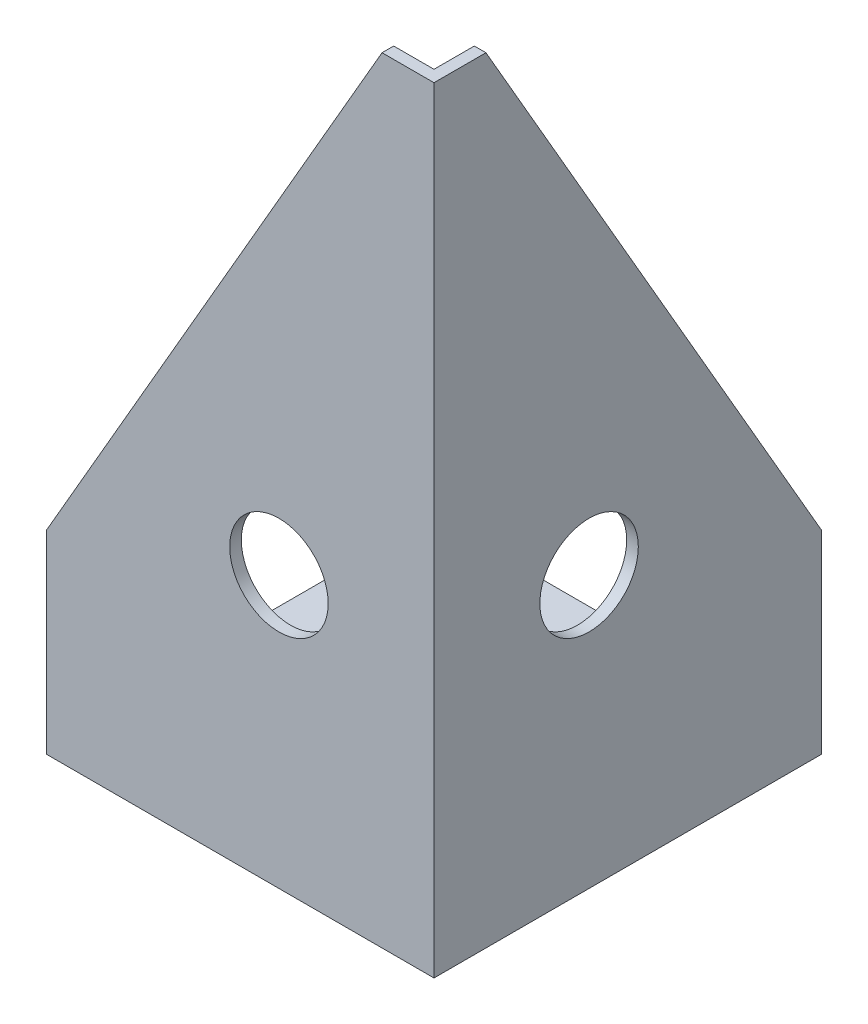
ISO-10303-21;
HEADER;
FILE_DESCRIPTION(('STEP AP214'),'2;1');
FILE_NAME('part.step','',(''),(''),'','','');
FILE_SCHEMA(('AUTOMOTIVE_DESIGN { 1 0 10303 214 1 1 1 1 }'));
ENDSEC;
DATA;
#1=APPLICATION_CONTEXT('core data for automotive mechanical design processes');
#2=APPLICATION_PROTOCOL_DEFINITION('international standard','automotive_design',2000,#1);
#3=PRODUCT_CONTEXT('',#1,'mechanical');
#4=PRODUCT('Part','Part','',(#3));
#5=PRODUCT_RELATED_PRODUCT_CATEGORY('part','',(#4));
#6=PRODUCT_DEFINITION_FORMATION('','',#4);
#7=PRODUCT_DEFINITION_CONTEXT('part definition',#1,'design');
#8=PRODUCT_DEFINITION('design','',#6,#7);
#9=PRODUCT_DEFINITION_SHAPE('','',#8);
#10=(LENGTH_UNIT() NAMED_UNIT(*) SI_UNIT(.MILLI.,.METRE.));
#11=(NAMED_UNIT(*) PLANE_ANGLE_UNIT() SI_UNIT($,.RADIAN.));
#12=(NAMED_UNIT(*) SI_UNIT($,.STERADIAN.) SOLID_ANGLE_UNIT());
#13=UNCERTAINTY_MEASURE_WITH_UNIT(LENGTH_MEASURE(1.E-05),#10,'distance_accuracy_value','');
#14=(GEOMETRIC_REPRESENTATION_CONTEXT(3) GLOBAL_UNCERTAINTY_ASSIGNED_CONTEXT((#13)) GLOBAL_UNIT_ASSIGNED_CONTEXT((#10,
#11,#12)) REPRESENTATION_CONTEXT('',''));
#15=CARTESIAN_POINT('',(0.,0.,0.));
#16=DIRECTION('',(0.,0.,1.));
#17=DIRECTION('',(1.,0.,0.));
#18=AXIS2_PLACEMENT_3D('',#15,#16,#17);
#19=CARTESIAN_POINT('',(0.,200.,0.));
#20=DIRECTION('',(1.,0.,0.));
#21=DIRECTION('',(0.,0.,-1.));
#22=AXIS2_PLACEMENT_3D('',#19,#20,#21);
#23=PLANE('',#22);
#24=DIRECTION('',(0.,-1.,0.));
#25=VECTOR('',#24,1.);
#26=CARTESIAN_POINT('',(0.,200.,0.));
#27=LINE('',#26,#25);
#28=CARTESIAN_POINT('',(0.,49.9999999999991,0.));
#29=VERTEX_POINT('',#28);
#30=CARTESIAN_POINT('',(0.,0.,0.));
#31=VERTEX_POINT('',#30);
#32=EDGE_CURVE('E160',#29,#31,#27,.T.);
#33=ORIENTED_EDGE('',*,*,#32,.F.);
#34=DIRECTION('',(0.,0.,-1.));
#35=VECTOR('',#34,1.);
#36=CARTESIAN_POINT('',(0.,49.9999999999991,0.));
#37=LINE('',#36,#35);
#38=CARTESIAN_POINT('',(0.,49.9999999999992,-3.));
#39=VERTEX_POINT('',#38);
#40=EDGE_CURVE('E170',#29,#39,#37,.T.);
#41=ORIENTED_EDGE('',*,*,#40,.T.);
#42=DIRECTION('',(0.,-1.,0.));
#43=VECTOR('',#42,1.);
#44=CARTESIAN_POINT('',(0.,200.,-3.));
#45=LINE('',#44,#43);
#46=CARTESIAN_POINT('',(0.,3.,-3.));
#47=VERTEX_POINT('',#46);
#48=EDGE_CURVE('E122',#39,#47,#45,.T.);
#49=ORIENTED_EDGE('',*,*,#48,.T.);
#50=DIRECTION('',(0.,0.,1.));
#51=VECTOR('',#50,1.);
#52=CARTESIAN_POINT('',(0.,3.,0.));
#53=LINE('',#52,#51);
#54=CARTESIAN_POINT('',(0.,3.,-100.));
#55=VERTEX_POINT('',#54);
#56=EDGE_CURVE('E112',#55,#47,#53,.T.);
#57=ORIENTED_EDGE('',*,*,#56,.F.);
#58=DIRECTION('',(0.,-1.,0.));
#59=VECTOR('',#58,1.);
#60=CARTESIAN_POINT('',(0.,200.,-100.));
#61=LINE('',#60,#59);
#62=CARTESIAN_POINT('',(0.,0.,-100.));
#63=VERTEX_POINT('',#62);
#64=EDGE_CURVE('E144',#55,#63,#61,.T.);
#65=ORIENTED_EDGE('',*,*,#64,.T.);
#66=DIRECTION('',(0.,0.,1.));
#67=VECTOR('',#66,1.);
#68=CARTESIAN_POINT('',(0.,0.,0.));
#69=LINE('',#68,#67);
#70=EDGE_CURVE('E137',#63,#31,#69,.T.);
#71=ORIENTED_EDGE('',*,*,#70,.T.);
#72=EDGE_LOOP('',(#33,#41,#49,#57,#65,#71));
#73=FACE_BOUND('',#72,.T.);
#74=ADVANCED_FACE('F35',(#73),#23,.F.);
#75=CARTESIAN_POINT('',(0.,200.,-100.));
#76=DIRECTION('',(0.,0.,1.));
#77=DIRECTION('',(1.,0.,0.));
#78=AXIS2_PLACEMENT_3D('',#75,#76,#77);
#79=PLANE('',#78);
#80=DIRECTION('',(0.,-1.,0.));
#81=VECTOR('',#80,1.);
#82=CARTESIAN_POINT('',(97.,200.,-100.));
#83=LINE('',#82,#81);
#84=CARTESIAN_POINT('',(97.,49.9999999999992,-100.));
#85=VERTEX_POINT('',#84);
#86=CARTESIAN_POINT('',(97.,3.,-100.));
#87=VERTEX_POINT('',#86);
#88=EDGE_CURVE('E123',#85,#87,#83,.T.);
#89=ORIENTED_EDGE('',*,*,#88,.F.);
#90=DIRECTION('',(1.,0.,0.));
#91=VECTOR('',#90,1.);
#92=CARTESIAN_POINT('',(0.,49.9999999999992,-100.));
#93=LINE('',#92,#91);
#94=CARTESIAN_POINT('',(100.,49.9999999999992,-100.));
#95=VERTEX_POINT('',#94);
#96=EDGE_CURVE('E43',#85,#95,#93,.T.);
#97=ORIENTED_EDGE('',*,*,#96,.T.);
#98=DIRECTION('',(0.,-1.,0.));
#99=VECTOR('',#98,1.);
#100=CARTESIAN_POINT('',(100.,200.,-100.));
#101=LINE('',#100,#99);
#102=CARTESIAN_POINT('',(100.,0.,-100.));
#103=VERTEX_POINT('',#102);
#104=EDGE_CURVE('E155',#95,#103,#101,.T.);
#105=ORIENTED_EDGE('',*,*,#104,.T.);
#106=DIRECTION('',(-1.,0.,0.));
#107=VECTOR('',#106,1.);
#108=CARTESIAN_POINT('',(0.,0.,-100.));
#109=LINE('',#108,#107);
#110=EDGE_CURVE('E141',#103,#63,#109,.T.);
#111=ORIENTED_EDGE('',*,*,#110,.T.);
#112=ORIENTED_EDGE('',*,*,#64,.F.);
#113=DIRECTION('',(-1.,0.,0.));
#114=VECTOR('',#113,1.);
#115=CARTESIAN_POINT('',(0.,3.,-100.));
#116=LINE('',#115,#114);
#117=EDGE_CURVE('E126',#87,#55,#116,.T.);
#118=ORIENTED_EDGE('',*,*,#117,.F.);
#119=EDGE_LOOP('',(#89,#97,#105,#111,#112,#118));
#120=FACE_BOUND('',#119,.T.);
#121=ADVANCED_FACE('F210',(#120),#79,.F.);
#122=CARTESIAN_POINT('',(0.,200.,0.));
#123=DIRECTION('',(0.,-1.,0.));
#124=DIRECTION('',(0.,0.,-1.));
#125=AXIS2_PLACEMENT_3D('',#122,#123,#124);
#126=PLANE('',#125);
#127=DIRECTION('',(1.,0.,0.));
#128=VECTOR('',#127,1.);
#129=CARTESIAN_POINT('',(0.,200.,-3.));
#130=LINE('',#129,#128);
#131=CARTESIAN_POINT('',(86.6025403784439,200.,-3.));
#132=VERTEX_POINT('',#131);
#133=CARTESIAN_POINT('',(97.,200.,-3.));
#134=VERTEX_POINT('',#133);
#135=EDGE_CURVE('E120',#132,#134,#130,.T.);
#136=ORIENTED_EDGE('',*,*,#135,.F.);
#137=DIRECTION('',(0.,0.,1.));
#138=VECTOR('',#137,1.);
#139=CARTESIAN_POINT('',(86.6025403784439,200.,0.));
#140=LINE('',#139,#138);
#141=CARTESIAN_POINT('',(86.6025403784439,200.,0.));
#142=VERTEX_POINT('',#141);
#143=EDGE_CURVE('E165',#132,#142,#140,.T.);
#144=ORIENTED_EDGE('',*,*,#143,.T.);
#145=DIRECTION('',(1.,0.,0.));
#146=VECTOR('',#145,1.);
#147=CARTESIAN_POINT('',(0.,200.,0.));
#148=LINE('',#147,#146);
#149=CARTESIAN_POINT('',(100.,200.,0.));
#150=VERTEX_POINT('',#149);
#151=EDGE_CURVE('E138',#142,#150,#148,.T.);
#152=ORIENTED_EDGE('',*,*,#151,.T.);
#153=DIRECTION('',(0.,0.,-1.));
#154=VECTOR('',#153,1.);
#155=CARTESIAN_POINT('',(100.,200.,0.));
#156=LINE('',#155,#154);
#157=CARTESIAN_POINT('',(100.,200.,-13.3974596215561));
#158=VERTEX_POINT('',#157);
#159=EDGE_CURVE('E140',#150,#158,#156,.T.);
#160=ORIENTED_EDGE('',*,*,#159,.T.);
#161=DIRECTION('',(-1.,0.,0.));
#162=VECTOR('',#161,1.);
#163=CARTESIAN_POINT('',(0.,200.,-13.3974596215561));
#164=LINE('',#163,#162);
#165=CARTESIAN_POINT('',(97.,200.,-13.3974596215561));
#166=VERTEX_POINT('',#165);
#167=EDGE_CURVE('E162',#158,#166,#164,.T.);
#168=ORIENTED_EDGE('',*,*,#167,.T.);
#169=DIRECTION('',(0.,0.,-1.));
#170=VECTOR('',#169,1.);
#171=CARTESIAN_POINT('',(97.,200.,0.));
#172=LINE('',#171,#170);
#173=EDGE_CURVE('E131',#134,#166,#172,.T.);
#174=ORIENTED_EDGE('',*,*,#173,.F.);
#175=EDGE_LOOP('',(#136,#144,#152,#160,#168,#174));
#176=FACE_BOUND('',#175,.T.);
#177=ADVANCED_FACE('F179',(#176),#126,.F.);
#178=CARTESIAN_POINT('',(0.,200.,0.));
#179=DIRECTION('',(0.,0.,-1.));
#180=DIRECTION('',(-1.,0.,0.));
#181=AXIS2_PLACEMENT_3D('',#178,#179,#180);
#182=PLANE('',#181);
#183=CARTESIAN_POINT('',(60.,70.,0.));
#184=DIRECTION('',(0.,0.,1.));
#185=DIRECTION('',(1.,0.,0.));
#186=AXIS2_PLACEMENT_3D('',#183,#184,#185);
#187=CIRCLE('',#186,12.7);
#188=CARTESIAN_POINT('',(72.7,70.,0.));
#189=VERTEX_POINT('',#188);
#190=EDGE_CURVE('E291',#189,#189,#187,.T.);
#191=ORIENTED_EDGE('',*,*,#190,.F.);
#192=EDGE_LOOP('',(#191));
#193=FACE_BOUND('',#192,.T.);
#194=ORIENTED_EDGE('',*,*,#151,.F.);
#195=DIRECTION('',(0.499999999999998,0.86602540378444,0.));
#196=VECTOR('',#195,1.);
#197=CARTESIAN_POINT('',(86.6025403784439,200.,0.));
#198=LINE('',#197,#196);
#199=EDGE_CURVE('E168',#142,#29,#198,.F.);
#200=ORIENTED_EDGE('',*,*,#199,.T.);
#201=ORIENTED_EDGE('',*,*,#32,.T.);
#202=DIRECTION('',(1.,0.,0.));
#203=VECTOR('',#202,1.);
#204=CARTESIAN_POINT('',(0.,0.,0.));
#205=LINE('',#204,#203);
#206=CARTESIAN_POINT('',(100.,0.,0.));
#207=VERTEX_POINT('',#206);
#208=EDGE_CURVE('E147',#31,#207,#205,.T.);
#209=ORIENTED_EDGE('',*,*,#208,.T.);
#210=DIRECTION('',(0.,-1.,0.));
#211=VECTOR('',#210,1.);
#212=CARTESIAN_POINT('',(100.,200.,0.));
#213=LINE('',#212,#211);
#214=EDGE_CURVE('E157',#150,#207,#213,.T.);
#215=ORIENTED_EDGE('',*,*,#214,.F.);
#216=EDGE_LOOP('',(#194,#200,#201,#209,#215));
#217=FACE_BOUND('',#216,.T.);
#218=ADVANCED_FACE('F184',(#193,#217),#182,.F.);
#219=CARTESIAN_POINT('',(100.,200.,0.));
#220=DIRECTION('',(-1.,0.,0.));
#221=DIRECTION('',(0.,0.,1.));
#222=AXIS2_PLACEMENT_3D('',#219,#220,#221);
#223=PLANE('',#222);
#224=CARTESIAN_POINT('',(100.,70.,-40.));
#225=DIRECTION('',(1.,0.,0.));
#226=DIRECTION('',(0.,0.,-1.));
#227=AXIS2_PLACEMENT_3D('',#224,#225,#226);
#228=CIRCLE('',#227,12.7);
#229=CARTESIAN_POINT('',(100.,70.,-52.7));
#230=VERTEX_POINT('',#229);
#231=EDGE_CURVE('E285',#230,#230,#228,.T.);
#232=ORIENTED_EDGE('',*,*,#231,.F.);
#233=EDGE_LOOP('',(#232));
#234=FACE_BOUND('',#233,.T.);
#235=ORIENTED_EDGE('',*,*,#104,.F.);
#236=DIRECTION('',(0.,-0.86602540378444,-0.499999999999998));
#237=VECTOR('',#236,1.);
#238=CARTESIAN_POINT('',(100.,200.,-13.3974596215561));
#239=LINE('',#238,#237);
#240=EDGE_CURVE('E11',#95,#158,#239,.F.);
#241=ORIENTED_EDGE('',*,*,#240,.T.);
#242=ORIENTED_EDGE('',*,*,#159,.F.);
#243=ORIENTED_EDGE('',*,*,#214,.T.);
#244=DIRECTION('',(0.,0.,-1.));
#245=VECTOR('',#244,1.);
#246=CARTESIAN_POINT('',(100.,0.,0.));
#247=LINE('',#246,#245);
#248=EDGE_CURVE('E149',#207,#103,#247,.T.);
#249=ORIENTED_EDGE('',*,*,#248,.T.);
#250=EDGE_LOOP('',(#235,#241,#242,#243,#249));
#251=FACE_BOUND('',#250,.T.);
#252=ADVANCED_FACE('F196',(#234,#251),#223,.F.);
#253=CARTESIAN_POINT('',(0.,0.,0.));
#254=DIRECTION('',(0.,-1.,0.));
#255=DIRECTION('',(0.,0.,-1.));
#256=AXIS2_PLACEMENT_3D('',#253,#254,#255);
#257=PLANE('',#256);
#258=CARTESIAN_POINT('',(90.,0.,-90.));
#259=DIRECTION('',(0.,-1.,0.));
#260=DIRECTION('',(0.,0.,-1.));
#261=AXIS2_PLACEMENT_3D('',#258,#259,#260);
#262=CIRCLE('',#261,5.50000000000001);
#263=CARTESIAN_POINT('',(90.,0.,-95.5));
#264=VERTEX_POINT('',#263);
#265=EDGE_CURVE('E263',#264,#264,#262,.T.);
#266=ORIENTED_EDGE('',*,*,#265,.F.);
#267=EDGE_LOOP('',(#266));
#268=FACE_BOUND('',#267,.T.);
#269=CARTESIAN_POINT('',(90.,0.,-10.));
#270=DIRECTION('',(0.,-1.,0.));
#271=DIRECTION('',(0.,0.,-1.));
#272=AXIS2_PLACEMENT_3D('',#269,#270,#271);
#273=CIRCLE('',#272,5.50000000000001);
#274=CARTESIAN_POINT('',(90.,0.,-15.5));
#275=VERTEX_POINT('',#274);
#276=EDGE_CURVE('E265',#275,#275,#273,.T.);
#277=ORIENTED_EDGE('',*,*,#276,.F.);
#278=EDGE_LOOP('',(#277));
#279=FACE_BOUND('',#278,.T.);
#280=CARTESIAN_POINT('',(60.,0.,-10.));
#281=DIRECTION('',(0.,-1.,0.));
#282=DIRECTION('',(0.,0.,-1.));
#283=AXIS2_PLACEMENT_3D('',#280,#281,#282);
#284=CIRCLE('',#283,5.5);
#285=CARTESIAN_POINT('',(60.,0.,-15.5));
#286=VERTEX_POINT('',#285);
#287=EDGE_CURVE('E273',#286,#286,#284,.T.);
#288=ORIENTED_EDGE('',*,*,#287,.F.);
#289=EDGE_LOOP('',(#288));
#290=FACE_BOUND('',#289,.T.);
#291=CARTESIAN_POINT('',(10.,0.,-9.99999999999999));
#292=DIRECTION('',(0.,-1.,0.));
#293=DIRECTION('',(0.,0.,-1.));
#294=AXIS2_PLACEMENT_3D('',#291,#292,#293);
#295=CIRCLE('',#294,5.5);
#296=CARTESIAN_POINT('',(10.,0.,-15.5));
#297=VERTEX_POINT('',#296);
#298=EDGE_CURVE('E279',#297,#297,#295,.T.);
#299=ORIENTED_EDGE('',*,*,#298,.F.);
#300=EDGE_LOOP('',(#299));
#301=FACE_BOUND('',#300,.T.);
#302=ORIENTED_EDGE('',*,*,#70,.F.);
#303=ORIENTED_EDGE('',*,*,#110,.F.);
#304=ORIENTED_EDGE('',*,*,#248,.F.);
#305=ORIENTED_EDGE('',*,*,#208,.F.);
#306=EDGE_LOOP('',(#302,#303,#304,#305));
#307=FACE_BOUND('',#306,.T.);
#308=ADVANCED_FACE('F192',(#268,#279,#290,#301,#307),#257,.T.);
#309=CARTESIAN_POINT('',(0.,200.,-3.));
#310=DIRECTION('',(0.,0.,-1.));
#311=DIRECTION('',(-1.,0.,0.));
#312=AXIS2_PLACEMENT_3D('',#309,#310,#311);
#313=PLANE('',#312);
#314=CARTESIAN_POINT('',(60.,70.,-3.));
#315=DIRECTION('',(0.,0.,-1.));
#316=DIRECTION('',(-1.,0.,0.));
#317=AXIS2_PLACEMENT_3D('',#314,#315,#316);
#318=CIRCLE('',#317,12.7);
#319=CARTESIAN_POINT('',(47.3,70.,-3.));
#320=VERTEX_POINT('',#319);
#321=EDGE_CURVE('E135',#320,#320,#318,.T.);
#322=ORIENTED_EDGE('',*,*,#321,.F.);
#323=EDGE_LOOP('',(#322));
#324=FACE_BOUND('',#323,.T.);
#325=ORIENTED_EDGE('',*,*,#48,.F.);
#326=DIRECTION('',(-0.499999999999998,-0.86602540378444,0.));
#327=VECTOR('',#326,1.);
#328=CARTESIAN_POINT('',(64.9519052838331,162.5,-3.));
#329=LINE('',#328,#327);
#330=EDGE_CURVE('E172',#39,#132,#329,.F.);
#331=ORIENTED_EDGE('',*,*,#330,.T.);
#332=ORIENTED_EDGE('',*,*,#135,.T.);
#333=DIRECTION('',(0.,-1.,0.));
#334=VECTOR('',#333,1.);
#335=CARTESIAN_POINT('',(97.,200.,-3.));
#336=LINE('',#335,#334);
#337=CARTESIAN_POINT('',(97.,3.,-3.));
#338=VERTEX_POINT('',#337);
#339=EDGE_CURVE('E117',#134,#338,#336,.T.);
#340=ORIENTED_EDGE('',*,*,#339,.T.);
#341=DIRECTION('',(1.,0.,0.));
#342=VECTOR('',#341,1.);
#343=CARTESIAN_POINT('',(0.,3.,-3.));
#344=LINE('',#343,#342);
#345=EDGE_CURVE('E105',#47,#338,#344,.T.);
#346=ORIENTED_EDGE('',*,*,#345,.F.);
#347=EDGE_LOOP('',(#325,#331,#332,#340,#346));
#348=FACE_BOUND('',#347,.T.);
#349=ADVANCED_FACE('F118',(#324,#348),#313,.T.);
#350=CARTESIAN_POINT('',(97.,200.,0.));
#351=DIRECTION('',(-1.,0.,0.));
#352=DIRECTION('',(0.,0.,1.));
#353=AXIS2_PLACEMENT_3D('',#350,#351,#352);
#354=PLANE('',#353);
#355=CARTESIAN_POINT('',(97.,70.,-40.));
#356=DIRECTION('',(-1.,0.,0.));
#357=DIRECTION('',(0.,0.,1.));
#358=AXIS2_PLACEMENT_3D('',#355,#356,#357);
#359=CIRCLE('',#358,12.7);
#360=CARTESIAN_POINT('',(97.,70.,-27.3));
#361=VERTEX_POINT('',#360);
#362=EDGE_CURVE('E288',#361,#361,#359,.T.);
#363=ORIENTED_EDGE('',*,*,#362,.F.);
#364=EDGE_LOOP('',(#363));
#365=FACE_BOUND('',#364,.T.);
#366=ORIENTED_EDGE('',*,*,#173,.T.);
#367=DIRECTION('',(0.,0.86602540378444,0.499999999999998));
#368=VECTOR('',#367,1.);
#369=CARTESIAN_POINT('',(97.,205.801270189222,-10.0480947161671));
#370=LINE('',#369,#368);
#371=EDGE_CURVE('E57',#166,#85,#370,.F.);
#372=ORIENTED_EDGE('',*,*,#371,.T.);
#373=ORIENTED_EDGE('',*,*,#88,.T.);
#374=DIRECTION('',(0.,0.,-1.));
#375=VECTOR('',#374,1.);
#376=CARTESIAN_POINT('',(97.,3.,0.));
#377=LINE('',#376,#375);
#378=EDGE_CURVE('E109',#338,#87,#377,.T.);
#379=ORIENTED_EDGE('',*,*,#378,.F.);
#380=ORIENTED_EDGE('',*,*,#339,.F.);
#381=EDGE_LOOP('',(#366,#372,#373,#379,#380));
#382=FACE_BOUND('',#381,.T.);
#383=ADVANCED_FACE('F125',(#365,#382),#354,.T.);
#384=CARTESIAN_POINT('',(0.,3.,0.));
#385=DIRECTION('',(0.,-1.,0.));
#386=DIRECTION('',(0.,0.,-1.));
#387=AXIS2_PLACEMENT_3D('',#384,#385,#386);
#388=PLANE('',#387);
#389=CARTESIAN_POINT('',(90.,3.,-90.));
#390=DIRECTION('',(0.,-1.,0.));
#391=DIRECTION('',(0.,0.,-1.));
#392=AXIS2_PLACEMENT_3D('',#389,#390,#391);
#393=CIRCLE('',#392,5.50000000000001);
#394=CARTESIAN_POINT('',(90.,3.,-95.5));
#395=VERTEX_POINT('',#394);
#396=EDGE_CURVE('E260',#395,#395,#393,.T.);
#397=ORIENTED_EDGE('',*,*,#396,.T.);
#398=EDGE_LOOP('',(#397));
#399=FACE_BOUND('',#398,.T.);
#400=CARTESIAN_POINT('',(90.,3.,-10.));
#401=DIRECTION('',(0.,-1.,0.));
#402=DIRECTION('',(0.,0.,-1.));
#403=AXIS2_PLACEMENT_3D('',#400,#401,#402);
#404=CIRCLE('',#403,5.50000000000001);
#405=CARTESIAN_POINT('',(90.,3.,-15.5));
#406=VERTEX_POINT('',#405);
#407=EDGE_CURVE('E270',#406,#406,#404,.T.);
#408=ORIENTED_EDGE('',*,*,#407,.T.);
#409=EDGE_LOOP('',(#408));
#410=FACE_BOUND('',#409,.T.);
#411=CARTESIAN_POINT('',(60.,3.,-10.));
#412=DIRECTION('',(0.,-1.,0.));
#413=DIRECTION('',(0.,0.,-1.));
#414=AXIS2_PLACEMENT_3D('',#411,#412,#413);
#415=CIRCLE('',#414,5.5);
#416=CARTESIAN_POINT('',(60.,3.,-15.5));
#417=VERTEX_POINT('',#416);
#418=EDGE_CURVE('E276',#417,#417,#415,.T.);
#419=ORIENTED_EDGE('',*,*,#418,.T.);
#420=EDGE_LOOP('',(#419));
#421=FACE_BOUND('',#420,.T.);
#422=CARTESIAN_POINT('',(10.,3.,-9.99999999999999));
#423=DIRECTION('',(0.,-1.,0.));
#424=DIRECTION('',(0.,0.,-1.));
#425=AXIS2_PLACEMENT_3D('',#422,#423,#424);
#426=CIRCLE('',#425,5.5);
#427=CARTESIAN_POINT('',(10.,3.,-15.5));
#428=VERTEX_POINT('',#427);
#429=EDGE_CURVE('E282',#428,#428,#426,.T.);
#430=ORIENTED_EDGE('',*,*,#429,.T.);
#431=EDGE_LOOP('',(#430));
#432=FACE_BOUND('',#431,.T.);
#433=ORIENTED_EDGE('',*,*,#56,.T.);
#434=ORIENTED_EDGE('',*,*,#345,.T.);
#435=ORIENTED_EDGE('',*,*,#378,.T.);
#436=ORIENTED_EDGE('',*,*,#117,.T.);
#437=EDGE_LOOP('',(#433,#434,#435,#436));
#438=FACE_BOUND('',#437,.T.);
#439=ADVANCED_FACE('F107',(#399,#410,#421,#432,#438),#388,.F.);
#440=CARTESIAN_POINT('',(86.6025403784439,200.,0.));
#441=DIRECTION('',(0.86602540378444,-0.499999999999998,0.));
#442=DIRECTION('',(0.,0.,1.));
#443=AXIS2_PLACEMENT_3D('',#440,#441,#442);
#444=PLANE('',#443);
#445=ORIENTED_EDGE('',*,*,#330,.F.);
#446=ORIENTED_EDGE('',*,*,#40,.F.);
#447=ORIENTED_EDGE('',*,*,#199,.F.);
#448=ORIENTED_EDGE('',*,*,#143,.F.);
#449=EDGE_LOOP('',(#445,#446,#447,#448));
#450=FACE_BOUND('',#449,.T.);
#451=ADVANCED_FACE('F181',(#450),#444,.F.);
#452=CARTESIAN_POINT('',(0.,200.,-13.3974596215561));
#453=DIRECTION('',(0.,-0.499999999999998,0.86602540378444));
#454=DIRECTION('',(-1.,0.,0.));
#455=AXIS2_PLACEMENT_3D('',#452,#453,#454);
#456=PLANE('',#455);
#457=ORIENTED_EDGE('',*,*,#240,.F.);
#458=ORIENTED_EDGE('',*,*,#96,.F.);
#459=ORIENTED_EDGE('',*,*,#371,.F.);
#460=ORIENTED_EDGE('',*,*,#167,.F.);
#461=EDGE_LOOP('',(#457,#458,#459,#460));
#462=FACE_BOUND('',#461,.T.);
#463=ADVANCED_FACE('F37',(#462),#456,.F.);
#464=CARTESIAN_POINT('',(60.,70.,0.));
#465=DIRECTION('',(0.,0.,1.));
#466=DIRECTION('',(1.,0.,0.));
#467=AXIS2_PLACEMENT_3D('',#464,#465,#466);
#468=CYLINDRICAL_SURFACE('',#467,12.7);
#469=ORIENTED_EDGE('',*,*,#190,.T.);
#470=EDGE_LOOP('',(#469));
#471=FACE_BOUND('',#470,.T.);
#472=ORIENTED_EDGE('',*,*,#321,.T.);
#473=EDGE_LOOP('',(#472));
#474=FACE_BOUND('',#473,.T.);
#475=ADVANCED_FACE('F201',(#471,#474),#468,.F.);
#476=CARTESIAN_POINT('',(100.,70.,-40.));
#477=DIRECTION('',(1.,0.,0.));
#478=DIRECTION('',(0.,0.,-1.));
#479=AXIS2_PLACEMENT_3D('',#476,#477,#478);
#480=CYLINDRICAL_SURFACE('',#479,12.7);
#481=ORIENTED_EDGE('',*,*,#231,.T.);
#482=EDGE_LOOP('',(#481));
#483=FACE_BOUND('',#482,.T.);
#484=ORIENTED_EDGE('',*,*,#362,.T.);
#485=EDGE_LOOP('',(#484));
#486=FACE_BOUND('',#485,.T.);
#487=ADVANCED_FACE('F206',(#483,#486),#480,.F.);
#488=CARTESIAN_POINT('',(10.,0.,-9.99999999999999));
#489=DIRECTION('',(0.,-1.,0.));
#490=DIRECTION('',(0.,0.,-1.));
#491=AXIS2_PLACEMENT_3D('',#488,#489,#490);
#492=CYLINDRICAL_SURFACE('',#491,5.5);
#493=ORIENTED_EDGE('',*,*,#429,.F.);
#494=EDGE_LOOP('',(#493));
#495=FACE_BOUND('',#494,.T.);
#496=ORIENTED_EDGE('',*,*,#298,.T.);
#497=EDGE_LOOP('',(#496));
#498=FACE_BOUND('',#497,.T.);
#499=ADVANCED_FACE('F239',(#495,#498),#492,.F.);
#500=CARTESIAN_POINT('',(60.,0.,-10.));
#501=DIRECTION('',(0.,-1.,0.));
#502=DIRECTION('',(0.,0.,-1.));
#503=AXIS2_PLACEMENT_3D('',#500,#501,#502);
#504=CYLINDRICAL_SURFACE('',#503,5.5);
#505=ORIENTED_EDGE('',*,*,#418,.F.);
#506=EDGE_LOOP('',(#505));
#507=FACE_BOUND('',#506,.T.);
#508=ORIENTED_EDGE('',*,*,#287,.T.);
#509=EDGE_LOOP('',(#508));
#510=FACE_BOUND('',#509,.T.);
#511=ADVANCED_FACE('F243',(#507,#510),#504,.F.);
#512=CARTESIAN_POINT('',(90.,0.,-10.));
#513=DIRECTION('',(0.,-1.,0.));
#514=DIRECTION('',(0.,0.,-1.));
#515=AXIS2_PLACEMENT_3D('',#512,#513,#514);
#516=CYLINDRICAL_SURFACE('',#515,5.50000000000001);
#517=ORIENTED_EDGE('',*,*,#407,.F.);
#518=EDGE_LOOP('',(#517));
#519=FACE_BOUND('',#518,.T.);
#520=ORIENTED_EDGE('',*,*,#276,.T.);
#521=EDGE_LOOP('',(#520));
#522=FACE_BOUND('',#521,.T.);
#523=ADVANCED_FACE('F247',(#519,#522),#516,.F.);
#524=CARTESIAN_POINT('',(90.,0.,-90.));
#525=DIRECTION('',(0.,-1.,0.));
#526=DIRECTION('',(0.,0.,-1.));
#527=AXIS2_PLACEMENT_3D('',#524,#525,#526);
#528=CYLINDRICAL_SURFACE('',#527,5.50000000000001);
#529=ORIENTED_EDGE('',*,*,#396,.F.);
#530=EDGE_LOOP('',(#529));
#531=FACE_BOUND('',#530,.T.);
#532=ORIENTED_EDGE('',*,*,#265,.T.);
#533=EDGE_LOOP('',(#532));
#534=FACE_BOUND('',#533,.T.);
#535=ADVANCED_FACE('F251',(#531,#534),#528,.F.);
#536=CLOSED_SHELL('',(#74,#121,#177,#218,#252,#308,#349,#383,#439,#451,#463,#475,#487,#499,#511,
#523,#535));
#537=MANIFOLD_SOLID_BREP('B2',#536);
#538=ADVANCED_BREP_SHAPE_REPRESENTATION('',(#18,#537),#14);
#539=SHAPE_DEFINITION_REPRESENTATION(#9,#538);
ENDSEC;
END-ISO-10303-21;
